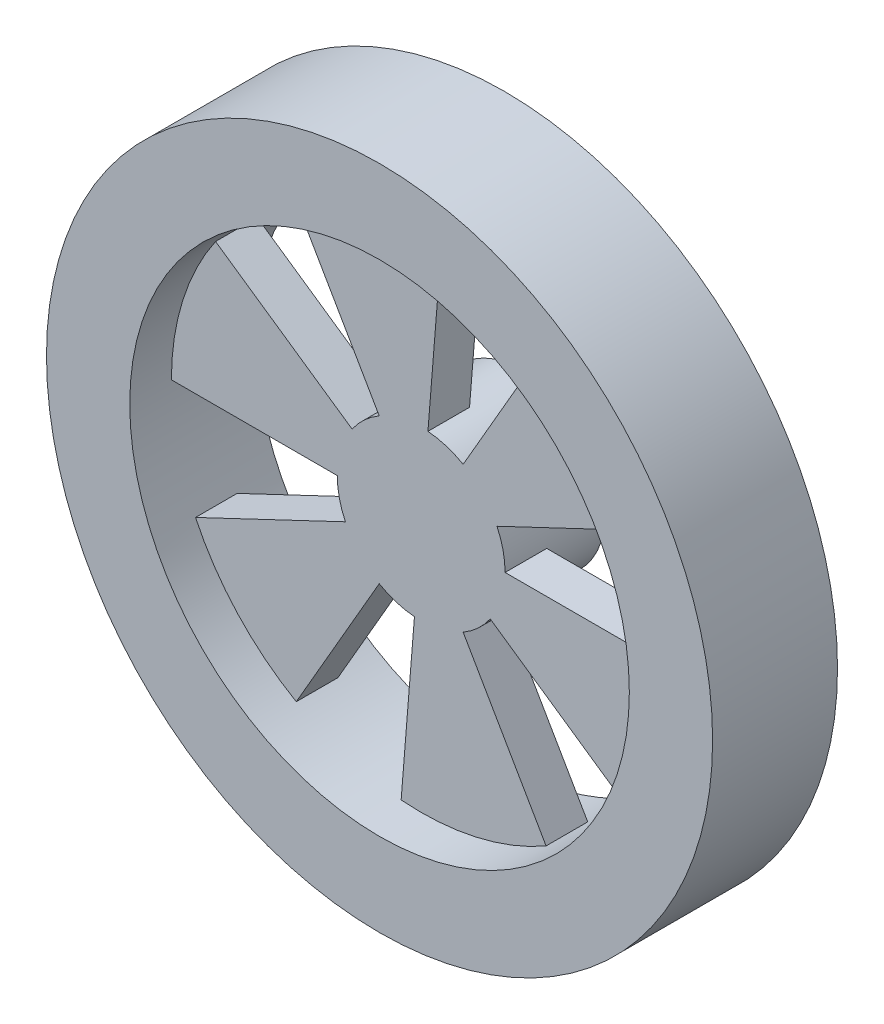
ISO-10303-21;
HEADER;
FILE_DESCRIPTION(('STEP AP214'),'2;1');
FILE_NAME('part.step','',(''),(''),'','','');
FILE_SCHEMA(('AUTOMOTIVE_DESIGN { 1 0 10303 214 1 1 1 1 }'));
ENDSEC;
DATA;
#1=APPLICATION_CONTEXT('core data for automotive mechanical design processes');
#2=APPLICATION_PROTOCOL_DEFINITION('international standard','automotive_design',2000,#1);
#3=PRODUCT_CONTEXT('',#1,'mechanical');
#4=PRODUCT('Part','Part','',(#3));
#5=PRODUCT_RELATED_PRODUCT_CATEGORY('part','',(#4));
#6=PRODUCT_DEFINITION_FORMATION('','',#4);
#7=PRODUCT_DEFINITION_CONTEXT('part definition',#1,'design');
#8=PRODUCT_DEFINITION('design','',#6,#7);
#9=PRODUCT_DEFINITION_SHAPE('','',#8);
#10=(LENGTH_UNIT() NAMED_UNIT(*) SI_UNIT(.MILLI.,.METRE.));
#11=(NAMED_UNIT(*) PLANE_ANGLE_UNIT() SI_UNIT($,.RADIAN.));
#12=(NAMED_UNIT(*) SI_UNIT($,.STERADIAN.) SOLID_ANGLE_UNIT());
#13=UNCERTAINTY_MEASURE_WITH_UNIT(LENGTH_MEASURE(1.E-05),#10,'distance_accuracy_value','');
#14=(GEOMETRIC_REPRESENTATION_CONTEXT(3) GLOBAL_UNCERTAINTY_ASSIGNED_CONTEXT((#13)) GLOBAL_UNIT_ASSIGNED_CONTEXT((#10,
#11,#12)) REPRESENTATION_CONTEXT('',''));
#15=CARTESIAN_POINT('',(0.,0.,0.));
#16=DIRECTION('',(0.,0.,1.));
#17=DIRECTION('',(1.,0.,0.));
#18=AXIS2_PLACEMENT_3D('',#15,#16,#17);
#19=CARTESIAN_POINT('',(0.,0.,5.));
#20=DIRECTION('',(0.,0.,-1.));
#21=DIRECTION('',(-1.,0.,0.));
#22=AXIS2_PLACEMENT_3D('',#19,#20,#21);
#23=PLANE('',#22);
#24=DIRECTION('',(0.0802856220974144,0.996771899124585,0.));
#25=VECTOR('',#24,1.);
#26=CARTESIAN_POINT('',(2.40856866292243,29.9031569737375,5.));
#27=LINE('',#26,#25);
#28=CARTESIAN_POINT('',(0.808992417805257,10.0439018544904,5.));
#29=VERTEX_POINT('',#28);
#30=CARTESIAN_POINT('',(2.40856866292243,29.9031569737375,5.));
#31=VERTEX_POINT('',#30);
#32=EDGE_CURVE('E263',#29,#31,#27,.T.);
#33=ORIENTED_EDGE('',*,*,#32,.F.);
#34=CARTESIAN_POINT('',(0.,0.,5.));
#35=DIRECTION('',(0.,0.,-1.));
#36=DIRECTION('',(-1.,0.,0.));
#37=AXIS2_PLACEMENT_3D('',#34,#35,#36);
#38=CIRCLE('',#37,10.0764295856569);
#39=CARTESIAN_POINT('',(-5.0382147928285,8.72644400062398,5.));
#40=VERTEX_POINT('',#39);
#41=EDGE_CURVE('E419',#40,#29,#38,.T.);
#42=ORIENTED_EDGE('',*,*,#41,.F.);
#43=DIRECTION('',(0.500000000000004,-0.866025403784436,0.));
#44=VECTOR('',#43,1.);
#45=CARTESIAN_POINT('',(-5.0382147928285,8.72644400062398,5.));
#46=LINE('',#45,#44);
#47=CARTESIAN_POINT('',(-15.0000000000001,25.9807621135331,5.));
#48=VERTEX_POINT('',#47);
#49=EDGE_CURVE('E288',#48,#40,#46,.T.);
#50=ORIENTED_EDGE('',*,*,#49,.F.);
#51=CARTESIAN_POINT('',(0.,0.,5.));
#52=DIRECTION('',(0.,0.,-1.));
#53=DIRECTION('',(-1.,0.,0.));
#54=AXIS2_PLACEMENT_3D('',#51,#52,#53);
#55=CIRCLE('',#54,30.);
#56=EDGE_CURVE('E426',#48,#31,#55,.T.);
#57=ORIENTED_EDGE('',*,*,#56,.T.);
#58=EDGE_LOOP('',(#33,#42,#50,#57));
#59=FACE_BOUND('',#58,.T.);
#60=ADVANCED_FACE('F39',(#59),#23,.T.);
#61=DIRECTION('',(-0.823086975371644,0.567915337857288,0.));
#62=VECTOR('',#61,1.);
#63=CARTESIAN_POINT('',(-24.6926092611493,17.0374601357187,5.));
#64=LINE('',#63,#62);
#65=CARTESIAN_POINT('',(-8.2937779502037,5.72255891253353,5.));
#66=VERTEX_POINT('',#65);
#67=CARTESIAN_POINT('',(-24.6926092611493,17.0374601357187,5.));
#68=VERTEX_POINT('',#67);
#69=EDGE_CURVE('E297',#66,#68,#64,.T.);
#70=ORIENTED_EDGE('',*,*,#69,.F.);
#71=CARTESIAN_POINT('',(-10.0764295856569,0.,5.));
#72=VERTEX_POINT('',#71);
#73=EDGE_CURVE('E415',#72,#66,#38,.T.);
#74=ORIENTED_EDGE('',*,*,#73,.F.);
#75=DIRECTION('',(1.,0.,0.));
#76=VECTOR('',#75,1.);
#77=CARTESIAN_POINT('',(-10.0764295856569,0.,5.));
#78=LINE('',#77,#76);
#79=CARTESIAN_POINT('',(-30.,-2.11223603806565E-13,5.));
#80=VERTEX_POINT('',#79);
#81=EDGE_CURVE('E350',#80,#72,#78,.T.);
#82=ORIENTED_EDGE('',*,*,#81,.F.);
#83=EDGE_CURVE('E421',#80,#68,#55,.T.);
#84=ORIENTED_EDGE('',*,*,#83,.T.);
#85=EDGE_LOOP('',(#70,#74,#82,#84));
#86=FACE_BOUND('',#85,.T.);
#87=ADVANCED_FACE('F498',(#86),#23,.T.);
#88=DIRECTION('',(-0.0802856220974074,-0.996771899124585,0.));
#89=VECTOR('',#88,1.);
#90=CARTESIAN_POINT('',(-2.40856866292222,-29.9031569737376,5.));
#91=LINE('',#90,#89);
#92=CARTESIAN_POINT('',(-0.808992417805189,-10.0439018544904,5.));
#93=VERTEX_POINT('',#92);
#94=CARTESIAN_POINT('',(-2.40856866292222,-29.9031569737376,5.));
#95=VERTEX_POINT('',#94);
#96=EDGE_CURVE('E244',#93,#95,#91,.T.);
#97=ORIENTED_EDGE('',*,*,#96,.F.);
#98=CARTESIAN_POINT('',(5.03821479282856,-8.72644400062394,5.));
#99=VERTEX_POINT('',#98);
#100=EDGE_CURVE('E565',#99,#93,#38,.T.);
#101=ORIENTED_EDGE('',*,*,#100,.F.);
#102=DIRECTION('',(-0.50000000000001,0.866025403784433,0.));
#103=VECTOR('',#102,1.);
#104=CARTESIAN_POINT('',(5.03821479282856,-8.72644400062394,5.));
#105=LINE('',#104,#103);
#106=CARTESIAN_POINT('',(15.0000000000003,-25.980762113533,5.));
#107=VERTEX_POINT('',#106);
#108=EDGE_CURVE('E231',#107,#99,#105,.T.);
#109=ORIENTED_EDGE('',*,*,#108,.F.);
#110=EDGE_CURVE('E540',#107,#95,#55,.T.);
#111=ORIENTED_EDGE('',*,*,#110,.T.);
#112=EDGE_LOOP('',(#97,#101,#109,#111));
#113=FACE_BOUND('',#112,.T.);
#114=ADVANCED_FACE('F505',(#113),#23,.T.);
#115=DIRECTION('',(0.499999999999992,0.866025403784443,0.));
#116=VECTOR('',#115,1.);
#117=CARTESIAN_POINT('',(-5.03821479282838,-8.72644400062405,5.));
#118=LINE('',#117,#116);
#119=CARTESIAN_POINT('',(-14.9999999999998,-25.9807621135333,5.));
#120=VERTEX_POINT('',#119);
#121=CARTESIAN_POINT('',(-5.03821479282838,-8.72644400062405,5.));
#122=VERTEX_POINT('',#121);
#123=EDGE_CURVE('E320',#120,#122,#118,.T.);
#124=ORIENTED_EDGE('',*,*,#123,.F.);
#125=CARTESIAN_POINT('',(-27.1011779240717,-12.865696838019,5.));
#126=VERTEX_POINT('',#125);
#127=EDGE_CURVE('E427',#120,#126,#55,.T.);
#128=ORIENTED_EDGE('',*,*,#127,.T.);
#129=DIRECTION('',(-0.903372597469055,-0.428856561267298,0.));
#130=VECTOR('',#129,1.);
#131=CARTESIAN_POINT('',(-27.1011779240717,-12.865696838019,5.));
#132=LINE('',#131,#130);
#133=CARTESIAN_POINT('',(-9.10277036800893,-4.3213429419569,5.));
#134=VERTEX_POINT('',#133);
#135=EDGE_CURVE('E337',#134,#126,#132,.T.);
#136=ORIENTED_EDGE('',*,*,#135,.F.);
#137=EDGE_CURVE('E420',#122,#134,#38,.T.);
#138=ORIENTED_EDGE('',*,*,#137,.F.);
#139=EDGE_LOOP('',(#124,#128,#136,#138));
#140=FACE_BOUND('',#139,.T.);
#141=ADVANCED_FACE('F525',(#140),#23,.T.);
#142=DIRECTION('',(0.823086975371648,-0.567915337857283,0.));
#143=VECTOR('',#142,1.);
#144=CARTESIAN_POINT('',(24.6926092611494,-17.0374601357185,5.));
#145=LINE('',#144,#143);
#146=CARTESIAN_POINT('',(8.29377795020374,-5.72255891253347,5.));
#147=VERTEX_POINT('',#146);
#148=CARTESIAN_POINT('',(24.6926092611494,-17.0374601357185,5.));
#149=VERTEX_POINT('',#148);
#150=EDGE_CURVE('E234',#147,#149,#145,.T.);
#151=ORIENTED_EDGE('',*,*,#150,.F.);
#152=CARTESIAN_POINT('',(10.0764295856569,0.,5.));
#153=VERTEX_POINT('',#152);
#154=EDGE_CURVE('E211',#153,#147,#38,.T.);
#155=ORIENTED_EDGE('',*,*,#154,.F.);
#156=DIRECTION('',(-1.,0.,0.));
#157=VECTOR('',#156,1.);
#158=CARTESIAN_POINT('',(10.0764295856569,0.,5.));
#159=LINE('',#158,#157);
#160=CARTESIAN_POINT('',(30.,0.,5.));
#161=VERTEX_POINT('',#160);
#162=EDGE_CURVE('E380',#161,#153,#159,.T.);
#163=ORIENTED_EDGE('',*,*,#162,.F.);
#164=EDGE_CURVE('E536',#161,#149,#55,.T.);
#165=ORIENTED_EDGE('',*,*,#164,.T.);
#166=EDGE_LOOP('',(#151,#155,#163,#165));
#167=FACE_BOUND('',#166,.T.);
#168=ADVANCED_FACE('F514',(#167),#23,.T.);
#169=CARTESIAN_POINT('',(0.,0.,10.));
#170=DIRECTION('',(0.,0.,1.));
#171=DIRECTION('',(1.,0.,0.));
#172=AXIS2_PLACEMENT_3D('',#169,#170,#171);
#173=PLANE('',#172);
#174=CARTESIAN_POINT('',(0.,0.,10.));
#175=DIRECTION('',(0.,0.,1.));
#176=DIRECTION('',(1.,0.,0.));
#177=AXIS2_PLACEMENT_3D('',#174,#175,#176);
#178=CIRCLE('',#177,30.);
#179=CARTESIAN_POINT('',(27.1011779240717,12.8656968380188,10.));
#180=VERTEX_POINT('',#179);
#181=CARTESIAN_POINT('',(14.9999999999999,25.9807621135332,10.));
#182=VERTEX_POINT('',#181);
#183=EDGE_CURVE('E411',#180,#182,#178,.T.);
#184=ORIENTED_EDGE('',*,*,#183,.T.);
#185=DIRECTION('',(-0.499999999999998,-0.86602540378444,0.));
#186=VECTOR('',#185,1.);
#187=CARTESIAN_POINT('',(5.03821479282844,8.72644400062401,10.));
#188=LINE('',#187,#186);
#189=CARTESIAN_POINT('',(5.03821479282844,8.72644400062401,10.));
#190=VERTEX_POINT('',#189);
#191=EDGE_CURVE('E258',#182,#190,#188,.T.);
#192=ORIENTED_EDGE('',*,*,#191,.T.);
#193=CARTESIAN_POINT('',(0.,0.,10.));
#194=DIRECTION('',(0.,0.,1.));
#195=DIRECTION('',(-1.,0.,0.));
#196=AXIS2_PLACEMENT_3D('',#193,#194,#195);
#197=CIRCLE('',#196,10.0764295856569);
#198=CARTESIAN_POINT('',(0.808992417805257,10.0439018544904,10.));
#199=VERTEX_POINT('',#198);
#200=EDGE_CURVE('E249',#190,#199,#197,.T.);
#201=ORIENTED_EDGE('',*,*,#200,.T.);
#202=DIRECTION('',(0.0802856220974144,0.996771899124585,0.));
#203=VECTOR('',#202,1.);
#204=CARTESIAN_POINT('',(2.40856866292243,29.9031569737375,10.));
#205=LINE('',#204,#203);
#206=CARTESIAN_POINT('',(2.40856866292243,29.9031569737375,10.));
#207=VERTEX_POINT('',#206);
#208=EDGE_CURVE('E253',#199,#207,#205,.T.);
#209=ORIENTED_EDGE('',*,*,#208,.T.);
#210=CARTESIAN_POINT('',(-15.0000000000001,25.9807621135331,10.));
#211=VERTEX_POINT('',#210);
#212=EDGE_CURVE('E569',#207,#211,#178,.T.);
#213=ORIENTED_EDGE('',*,*,#212,.T.);
#214=DIRECTION('',(0.500000000000004,-0.866025403784436,0.));
#215=VECTOR('',#214,1.);
#216=CARTESIAN_POINT('',(-5.0382147928285,8.72644400062398,10.));
#217=LINE('',#216,#215);
#218=CARTESIAN_POINT('',(-5.0382147928285,8.72644400062398,10.));
#219=VERTEX_POINT('',#218);
#220=EDGE_CURVE('E292',#211,#219,#217,.T.);
#221=ORIENTED_EDGE('',*,*,#220,.T.);
#222=CARTESIAN_POINT('',(0.,0.,10.));
#223=DIRECTION('',(0.,0.,1.));
#224=DIRECTION('',(-1.,0.,0.));
#225=AXIS2_PLACEMENT_3D('',#222,#223,#224);
#226=CIRCLE('',#225,10.0764295856569);
#227=CARTESIAN_POINT('',(-8.2937779502037,5.72255891253353,10.));
#228=VERTEX_POINT('',#227);
#229=EDGE_CURVE('E283',#219,#228,#226,.T.);
#230=ORIENTED_EDGE('',*,*,#229,.T.);
#231=DIRECTION('',(-0.823086975371644,0.567915337857288,0.));
#232=VECTOR('',#231,1.);
#233=CARTESIAN_POINT('',(-24.6926092611493,17.0374601357187,10.));
#234=LINE('',#233,#232);
#235=CARTESIAN_POINT('',(-24.6926092611493,17.0374601357187,10.));
#236=VERTEX_POINT('',#235);
#237=EDGE_CURVE('E287',#228,#236,#234,.T.);
#238=ORIENTED_EDGE('',*,*,#237,.T.);
#239=CARTESIAN_POINT('',(-30.,-2.11223603806565E-13,10.));
#240=VERTEX_POINT('',#239);
#241=EDGE_CURVE('E573',#236,#240,#178,.T.);
#242=ORIENTED_EDGE('',*,*,#241,.T.);
#243=DIRECTION('',(1.,0.,0.));
#244=VECTOR('',#243,1.);
#245=CARTESIAN_POINT('',(-10.0764295856569,0.,10.));
#246=LINE('',#245,#244);
#247=CARTESIAN_POINT('',(-10.0764295856569,0.,10.));
#248=VERTEX_POINT('',#247);
#249=EDGE_CURVE('E354',#240,#248,#246,.T.);
#250=ORIENTED_EDGE('',*,*,#249,.T.);
#251=CARTESIAN_POINT('',(0.,0.,10.));
#252=DIRECTION('',(0.,0.,1.));
#253=DIRECTION('',(-1.,0.,0.));
#254=AXIS2_PLACEMENT_3D('',#251,#252,#253);
#255=CIRCLE('',#254,10.0764295856569);
#256=CARTESIAN_POINT('',(-9.10277036800893,-4.3213429419569,10.));
#257=VERTEX_POINT('',#256);
#258=EDGE_CURVE('E345',#248,#257,#255,.T.);
#259=ORIENTED_EDGE('',*,*,#258,.T.);
#260=DIRECTION('',(-0.903372597469055,-0.428856561267298,0.));
#261=VECTOR('',#260,1.);
#262=CARTESIAN_POINT('',(-27.1011779240717,-12.865696838019,10.));
#263=LINE('',#262,#261);
#264=CARTESIAN_POINT('',(-27.1011779240717,-12.865696838019,10.));
#265=VERTEX_POINT('',#264);
#266=EDGE_CURVE('E349',#257,#265,#263,.T.);
#267=ORIENTED_EDGE('',*,*,#266,.T.);
#268=CARTESIAN_POINT('',(-14.9999999999998,-25.9807621135333,10.));
#269=VERTEX_POINT('',#268);
#270=EDGE_CURVE('E558',#265,#269,#178,.T.);
#271=ORIENTED_EDGE('',*,*,#270,.T.);
#272=DIRECTION('',(0.499999999999992,0.866025403784443,0.));
#273=VECTOR('',#272,1.);
#274=CARTESIAN_POINT('',(-5.03821479282838,-8.72644400062405,10.));
#275=LINE('',#274,#273);
#276=CARTESIAN_POINT('',(-5.03821479282838,-8.72644400062405,10.));
#277=VERTEX_POINT('',#276);
#278=EDGE_CURVE('E324',#269,#277,#275,.T.);
#279=ORIENTED_EDGE('',*,*,#278,.T.);
#280=CARTESIAN_POINT('',(0.,0.,10.));
#281=DIRECTION('',(0.,0.,1.));
#282=DIRECTION('',(-1.,0.,0.));
#283=AXIS2_PLACEMENT_3D('',#280,#281,#282);
#284=CIRCLE('',#283,10.0764295856569);
#285=CARTESIAN_POINT('',(-0.808992417805189,-10.0439018544904,10.));
#286=VERTEX_POINT('',#285);
#287=EDGE_CURVE('E315',#277,#286,#284,.T.);
#288=ORIENTED_EDGE('',*,*,#287,.T.);
#289=DIRECTION('',(-0.0802856220974074,-0.996771899124585,0.));
#290=VECTOR('',#289,1.);
#291=CARTESIAN_POINT('',(-2.40856866292222,-29.9031569737376,10.));
#292=LINE('',#291,#290);
#293=CARTESIAN_POINT('',(-2.40856866292222,-29.9031569737376,10.));
#294=VERTEX_POINT('',#293);
#295=EDGE_CURVE('E319',#286,#294,#292,.T.);
#296=ORIENTED_EDGE('',*,*,#295,.T.);
#297=CARTESIAN_POINT('',(15.0000000000003,-25.980762113533,10.));
#298=VERTEX_POINT('',#297);
#299=EDGE_CURVE('E410',#294,#298,#178,.T.);
#300=ORIENTED_EDGE('',*,*,#299,.T.);
#301=DIRECTION('',(-0.50000000000001,0.866025403784433,0.));
#302=VECTOR('',#301,1.);
#303=CARTESIAN_POINT('',(5.03821479282856,-8.72644400062394,10.));
#304=LINE('',#303,#302);
#305=CARTESIAN_POINT('',(5.03821479282856,-8.72644400062394,10.));
#306=VERTEX_POINT('',#305);
#307=EDGE_CURVE('E217',#298,#306,#304,.T.);
#308=ORIENTED_EDGE('',*,*,#307,.T.);
#309=CARTESIAN_POINT('',(0.,0.,10.));
#310=DIRECTION('',(0.,0.,1.));
#311=DIRECTION('',(-1.,0.,0.));
#312=AXIS2_PLACEMENT_3D('',#309,#310,#311);
#313=CIRCLE('',#312,10.0764295856569);
#314=CARTESIAN_POINT('',(8.29377795020374,-5.72255891253347,10.));
#315=VERTEX_POINT('',#314);
#316=EDGE_CURVE('E208',#306,#315,#313,.T.);
#317=ORIENTED_EDGE('',*,*,#316,.T.);
#318=DIRECTION('',(0.823086975371648,-0.567915337857283,0.));
#319=VECTOR('',#318,1.);
#320=CARTESIAN_POINT('',(24.6926092611494,-17.0374601357185,10.));
#321=LINE('',#320,#319);
#322=CARTESIAN_POINT('',(24.6926092611494,-17.0374601357185,10.));
#323=VERTEX_POINT('',#322);
#324=EDGE_CURVE('E220',#315,#323,#321,.T.);
#325=ORIENTED_EDGE('',*,*,#324,.T.);
#326=CARTESIAN_POINT('',(30.,0.,10.));
#327=VERTEX_POINT('',#326);
#328=EDGE_CURVE('E407',#323,#327,#178,.T.);
#329=ORIENTED_EDGE('',*,*,#328,.T.);
#330=DIRECTION('',(-1.,0.,0.));
#331=VECTOR('',#330,1.);
#332=CARTESIAN_POINT('',(10.0764295856569,0.,10.));
#333=LINE('',#332,#331);
#334=CARTESIAN_POINT('',(10.0764295856569,0.,10.));
#335=VERTEX_POINT('',#334);
#336=EDGE_CURVE('E384',#327,#335,#333,.T.);
#337=ORIENTED_EDGE('',*,*,#336,.T.);
#338=CARTESIAN_POINT('',(0.,0.,10.));
#339=DIRECTION('',(0.,0.,1.));
#340=DIRECTION('',(-1.,0.,0.));
#341=AXIS2_PLACEMENT_3D('',#338,#339,#340);
#342=CIRCLE('',#341,10.0764295856569);
#343=CARTESIAN_POINT('',(9.10277036800896,4.32134294195683,10.));
#344=VERTEX_POINT('',#343);
#345=EDGE_CURVE('E375',#335,#344,#342,.T.);
#346=ORIENTED_EDGE('',*,*,#345,.T.);
#347=DIRECTION('',(0.903372597469058,0.428856561267292,0.));
#348=VECTOR('',#347,1.);
#349=CARTESIAN_POINT('',(27.1011779240717,12.8656968380188,10.));
#350=LINE('',#349,#348);
#351=EDGE_CURVE('E379',#344,#180,#350,.T.);
#352=ORIENTED_EDGE('',*,*,#351,.T.);
#353=EDGE_LOOP('',(#184,#192,#201,#209,#213,#221,#230,#238,#242,#250,#259,#267,#271,#279,#288,
#296,#300,#308,#317,#325,#329,#337,#346,#352));
#354=FACE_BOUND('',#353,.T.);
#355=ADVANCED_FACE('F228',(#354),#173,.T.);
#356=CARTESIAN_POINT('',(0.,0.,-20.));
#357=DIRECTION('',(0.,0.,1.));
#358=DIRECTION('',(1.,0.,0.));
#359=AXIS2_PLACEMENT_3D('',#356,#357,#358);
#360=CYLINDRICAL_SURFACE('',#359,7.5);
#361=CARTESIAN_POINT('',(0.,0.,-20.));
#362=DIRECTION('',(0.,0.,1.));
#363=DIRECTION('',(1.,0.,0.));
#364=AXIS2_PLACEMENT_3D('',#361,#362,#363);
#365=CIRCLE('',#364,7.5);
#366=CARTESIAN_POINT('',(7.5,0.,-20.));
#367=VERTEX_POINT('',#366);
#368=EDGE_CURVE('E463',#367,#367,#365,.T.);
#369=ORIENTED_EDGE('',*,*,#368,.T.);
#370=EDGE_LOOP('',(#369));
#371=FACE_BOUND('',#370,.T.);
#372=CARTESIAN_POINT('',(0.,0.,-13.5));
#373=DIRECTION('',(0.,0.,-1.));
#374=DIRECTION('',(-1.,0.,0.));
#375=AXIS2_PLACEMENT_3D('',#372,#373,#374);
#376=CIRCLE('',#375,7.5);
#377=CARTESIAN_POINT('',(-7.5,0.,-13.5));
#378=VERTEX_POINT('',#377);
#379=EDGE_CURVE('E442',#378,#378,#376,.T.);
#380=ORIENTED_EDGE('',*,*,#379,.T.);
#381=EDGE_LOOP('',(#380));
#382=FACE_BOUND('',#381,.T.);
#383=ADVANCED_FACE('F531',(#371,#382),#360,.T.);
#384=CARTESIAN_POINT('',(0.,0.,-20.));
#385=DIRECTION('',(0.,0.,1.));
#386=DIRECTION('',(1.,0.,0.));
#387=AXIS2_PLACEMENT_3D('',#384,#385,#386);
#388=PLANE('',#387);
#389=CARTESIAN_POINT('',(0.,0.,-20.));
#390=DIRECTION('',(0.,0.,-1.));
#391=DIRECTION('',(-1.,0.,0.));
#392=AXIS2_PLACEMENT_3D('',#389,#390,#391);
#393=CIRCLE('',#392,3.175);
#394=CARTESIAN_POINT('',(-3.175,0.,-20.));
#395=VERTEX_POINT('',#394);
#396=EDGE_CURVE('E450',#395,#395,#393,.T.);
#397=ORIENTED_EDGE('',*,*,#396,.F.);
#398=EDGE_LOOP('',(#397));
#399=FACE_BOUND('',#398,.T.);
#400=ORIENTED_EDGE('',*,*,#368,.F.);
#401=EDGE_LOOP('',(#400));
#402=FACE_BOUND('',#401,.T.);
#403=ADVANCED_FACE('F834',(#399,#402),#388,.F.);
#404=CARTESIAN_POINT('',(0.,0.,-18.4));
#405=DIRECTION('',(0.,0.,-1.));
#406=DIRECTION('',(-1.,0.,0.));
#407=AXIS2_PLACEMENT_3D('',#404,#405,#406);
#408=PLANE('',#407);
#409=CARTESIAN_POINT('',(0.,0.,-18.4));
#410=DIRECTION('',(0.,0.,-1.));
#411=DIRECTION('',(-1.,0.,0.));
#412=AXIS2_PLACEMENT_3D('',#409,#410,#411);
#413=CIRCLE('',#412,3.175);
#414=CARTESIAN_POINT('',(-3.175,0.,-18.4));
#415=VERTEX_POINT('',#414);
#416=EDGE_CURVE('E451',#415,#415,#413,.T.);
#417=ORIENTED_EDGE('',*,*,#416,.T.);
#418=EDGE_LOOP('',(#417));
#419=FACE_BOUND('',#418,.T.);
#420=CARTESIAN_POINT('',(0.,0.,-18.4));
#421=DIRECTION('',(0.,0.,-1.));
#422=DIRECTION('',(-1.,0.,0.));
#423=AXIS2_PLACEMENT_3D('',#420,#421,#422);
#424=CIRCLE('',#423,1.);
#425=CARTESIAN_POINT('',(-1.,0.,-18.4));
#426=VERTEX_POINT('',#425);
#427=EDGE_CURVE('E455',#426,#426,#424,.F.);
#428=ORIENTED_EDGE('',*,*,#427,.T.);
#429=EDGE_LOOP('',(#428));
#430=FACE_BOUND('',#429,.T.);
#431=ADVANCED_FACE('F477',(#419,#430),#408,.T.);
#432=CARTESIAN_POINT('',(0.,0.,-18.4));
#433=DIRECTION('',(0.,0.,-1.));
#434=DIRECTION('',(-1.,0.,0.));
#435=AXIS2_PLACEMENT_3D('',#432,#433,#434);
#436=CYLINDRICAL_SURFACE('',#435,3.175);
#437=ORIENTED_EDGE('',*,*,#416,.F.);
#438=EDGE_LOOP('',(#437));
#439=FACE_BOUND('',#438,.T.);
#440=ORIENTED_EDGE('',*,*,#396,.T.);
#441=EDGE_LOOP('',(#440));
#442=FACE_BOUND('',#441,.T.);
#443=ADVANCED_FACE('F492',(#439,#442),#436,.F.);
#444=CARTESIAN_POINT('',(0.,0.,0.));
#445=DIRECTION('',(0.,0.,1.));
#446=DIRECTION('',(1.,0.,0.));
#447=AXIS2_PLACEMENT_3D('',#444,#445,#446);
#448=PLANE('',#447);
#449=CARTESIAN_POINT('',(0.,0.,0.));
#450=DIRECTION('',(0.,0.,1.));
#451=DIRECTION('',(1.,0.,0.));
#452=AXIS2_PLACEMENT_3D('',#449,#450,#451);
#453=CIRCLE('',#452,1.);
#454=CARTESIAN_POINT('',(1.,0.,0.));
#455=VERTEX_POINT('',#454);
#456=EDGE_CURVE('E48',#455,#455,#453,.T.);
#457=ORIENTED_EDGE('',*,*,#456,.F.);
#458=EDGE_LOOP('',(#457));
#459=FACE_BOUND('',#458,.T.);
#460=ADVANCED_FACE('F482',(#459),#448,.F.);
#461=CARTESIAN_POINT('',(0.,0.,-20.));
#462=DIRECTION('',(0.,0.,1.));
#463=DIRECTION('',(1.,0.,0.));
#464=AXIS2_PLACEMENT_3D('',#461,#462,#463);
#465=CYLINDRICAL_SURFACE('',#464,1.);
#466=ORIENTED_EDGE('',*,*,#456,.T.);
#467=EDGE_LOOP('',(#466));
#468=FACE_BOUND('',#467,.T.);
#469=ORIENTED_EDGE('',*,*,#427,.F.);
#470=EDGE_LOOP('',(#469));
#471=FACE_BOUND('',#470,.T.);
#472=ADVANCED_FACE('F479',(#468,#471),#465,.F.);
#473=CARTESIAN_POINT('',(0.,7.5,-13.5));
#474=DIRECTION('',(0.,0.,1.));
#475=DIRECTION('',(1.,0.,0.));
#476=AXIS2_PLACEMENT_3D('',#473,#474,#475);
#477=PLANE('',#476);
#478=CARTESIAN_POINT('',(0.,0.,-13.5));
#479=DIRECTION('',(0.,0.,-1.));
#480=DIRECTION('',(-1.,0.,0.));
#481=AXIS2_PLACEMENT_3D('',#478,#479,#480);
#482=CIRCLE('',#481,6.5);
#483=CARTESIAN_POINT('',(-6.5,0.,-13.5));
#484=VERTEX_POINT('',#483);
#485=EDGE_CURVE('E438',#484,#484,#482,.T.);
#486=ORIENTED_EDGE('',*,*,#485,.T.);
#487=EDGE_LOOP('',(#486));
#488=FACE_BOUND('',#487,.T.);
#489=ORIENTED_EDGE('',*,*,#379,.F.);
#490=EDGE_LOOP('',(#489));
#491=FACE_BOUND('',#490,.T.);
#492=ADVANCED_FACE('F481',(#488,#491),#477,.T.);
#493=CARTESIAN_POINT('',(0.,0.,-21.75));
#494=DIRECTION('',(0.,0.,-1.));
#495=DIRECTION('',(-1.,0.,0.));
#496=AXIS2_PLACEMENT_3D('',#493,#494,#495);
#497=CYLINDRICAL_SURFACE('',#496,6.5);
#498=ORIENTED_EDGE('',*,*,#485,.F.);
#499=EDGE_LOOP('',(#498));
#500=FACE_BOUND('',#499,.T.);
#501=CARTESIAN_POINT('',(0.,0.,-12.));
#502=DIRECTION('',(0.,0.,-1.));
#503=DIRECTION('',(-1.,0.,0.));
#504=AXIS2_PLACEMENT_3D('',#501,#502,#503);
#505=CIRCLE('',#504,6.5);
#506=CARTESIAN_POINT('',(-6.5,0.,-12.));
#507=VERTEX_POINT('',#506);
#508=EDGE_CURVE('E434',#507,#507,#505,.T.);
#509=ORIENTED_EDGE('',*,*,#508,.T.);
#510=EDGE_LOOP('',(#509));
#511=FACE_BOUND('',#510,.T.);
#512=ADVANCED_FACE('F489',(#500,#511),#497,.T.);
#513=CARTESIAN_POINT('',(0.,7.5,-12.));
#514=DIRECTION('',(0.,0.,1.));
#515=DIRECTION('',(1.,0.,0.));
#516=AXIS2_PLACEMENT_3D('',#513,#514,#515);
#517=PLANE('',#516);
#518=ORIENTED_EDGE('',*,*,#508,.F.);
#519=EDGE_LOOP('',(#518));
#520=FACE_BOUND('',#519,.T.);
#521=CARTESIAN_POINT('',(0.,0.,-12.));
#522=DIRECTION('',(0.,0.,-1.));
#523=DIRECTION('',(-1.,0.,0.));
#524=AXIS2_PLACEMENT_3D('',#521,#522,#523);
#525=CIRCLE('',#524,7.5);
#526=CARTESIAN_POINT('',(-7.5,0.,-12.));
#527=VERTEX_POINT('',#526);
#528=EDGE_CURVE('E425',#527,#527,#525,.T.);
#529=ORIENTED_EDGE('',*,*,#528,.T.);
#530=EDGE_LOOP('',(#529));
#531=FACE_BOUND('',#530,.T.);
#532=ADVANCED_FACE('F784',(#520,#531),#517,.F.);
#533=CARTESIAN_POINT('',(0.,0.,-21.75));
#534=DIRECTION('',(0.,0.,-1.));
#535=DIRECTION('',(-1.,0.,0.));
#536=AXIS2_PLACEMENT_3D('',#533,#534,#535);
#537=CYLINDRICAL_SURFACE('',#536,10.0764295856569);
#538=CARTESIAN_POINT('',(0.,0.,-2.));
#539=DIRECTION('',(0.,0.,-1.));
#540=DIRECTION('',(-1.,0.,0.));
#541=AXIS2_PLACEMENT_3D('',#538,#539,#540);
#542=CIRCLE('',#541,10.0764295856569);
#543=CARTESIAN_POINT('',(-10.0764295856569,0.,-2.));
#544=VERTEX_POINT('',#543);
#545=EDGE_CURVE('E446',#544,#544,#542,.T.);
#546=ORIENTED_EDGE('',*,*,#545,.F.);
#547=EDGE_LOOP('',(#546));
#548=FACE_BOUND('',#547,.T.);
#549=ORIENTED_EDGE('',*,*,#73,.T.);
#550=DIRECTION('',(0.,0.,-1.));
#551=VECTOR('',#550,1.);
#552=CARTESIAN_POINT('',(-8.2937779502037,5.72255891253353,10.));
#553=LINE('',#552,#551);
#554=EDGE_CURVE('E296',#228,#66,#553,.T.);
#555=ORIENTED_EDGE('',*,*,#554,.F.);
#556=ORIENTED_EDGE('',*,*,#229,.F.);
#557=DIRECTION('',(0.,0.,-1.));
#558=VECTOR('',#557,1.);
#559=CARTESIAN_POINT('',(-5.0382147928285,8.72644400062398,10.));
#560=LINE('',#559,#558);
#561=EDGE_CURVE('E267',#219,#40,#560,.T.);
#562=ORIENTED_EDGE('',*,*,#561,.T.);
#563=ORIENTED_EDGE('',*,*,#41,.T.);
#564=DIRECTION('',(0.,0.,-1.));
#565=VECTOR('',#564,1.);
#566=CARTESIAN_POINT('',(0.808992417805257,10.0439018544904,10.));
#567=LINE('',#566,#565);
#568=EDGE_CURVE('E262',#199,#29,#567,.T.);
#569=ORIENTED_EDGE('',*,*,#568,.F.);
#570=ORIENTED_EDGE('',*,*,#200,.F.);
#571=DIRECTION('',(0.,0.,-1.));
#572=VECTOR('',#571,1.);
#573=CARTESIAN_POINT('',(5.03821479282844,8.72644400062401,10.));
#574=LINE('',#573,#572);
#575=CARTESIAN_POINT('',(5.03821479282844,8.72644400062401,5.));
#576=VERTEX_POINT('',#575);
#577=EDGE_CURVE('E271',#190,#576,#574,.T.);
#578=ORIENTED_EDGE('',*,*,#577,.T.);
#579=CARTESIAN_POINT('',(9.10277036800896,4.32134294195683,5.));
#580=VERTEX_POINT('',#579);
#581=EDGE_CURVE('E951',#576,#580,#38,.T.);
#582=ORIENTED_EDGE('',*,*,#581,.T.);
#583=DIRECTION('',(0.,0.,-1.));
#584=VECTOR('',#583,1.);
#585=CARTESIAN_POINT('',(9.10277036800896,4.32134294195683,10.));
#586=LINE('',#585,#584);
#587=EDGE_CURVE('E388',#344,#580,#586,.T.);
#588=ORIENTED_EDGE('',*,*,#587,.F.);
#589=ORIENTED_EDGE('',*,*,#345,.F.);
#590=DIRECTION('',(0.,0.,-1.));
#591=VECTOR('',#590,1.);
#592=CARTESIAN_POINT('',(10.0764295856569,0.,10.));
#593=LINE('',#592,#591);
#594=EDGE_CURVE('E395',#335,#153,#593,.T.);
#595=ORIENTED_EDGE('',*,*,#594,.T.);
#596=ORIENTED_EDGE('',*,*,#154,.T.);
#597=DIRECTION('',(0.,0.,-1.));
#598=VECTOR('',#597,1.);
#599=CARTESIAN_POINT('',(8.29377795020374,-5.72255891253347,10.));
#600=LINE('',#599,#598);
#601=EDGE_CURVE('E203',#315,#147,#600,.T.);
#602=ORIENTED_EDGE('',*,*,#601,.F.);
#603=ORIENTED_EDGE('',*,*,#316,.F.);
#604=DIRECTION('',(0.,0.,-1.));
#605=VECTOR('',#604,1.);
#606=CARTESIAN_POINT('',(5.03821479282856,-8.72644400062394,10.));
#607=LINE('',#606,#605);
#608=EDGE_CURVE('E241',#306,#99,#607,.T.);
#609=ORIENTED_EDGE('',*,*,#608,.T.);
#610=ORIENTED_EDGE('',*,*,#100,.T.);
#611=DIRECTION('',(0.,0.,-1.));
#612=VECTOR('',#611,1.);
#613=CARTESIAN_POINT('',(-0.808992417805189,-10.0439018544904,10.));
#614=LINE('',#613,#612);
#615=EDGE_CURVE('E328',#286,#93,#614,.T.);
#616=ORIENTED_EDGE('',*,*,#615,.F.);
#617=ORIENTED_EDGE('',*,*,#287,.F.);
#618=DIRECTION('',(0.,0.,-1.));
#619=VECTOR('',#618,1.);
#620=CARTESIAN_POINT('',(-5.03821479282838,-8.72644400062405,10.));
#621=LINE('',#620,#619);
#622=EDGE_CURVE('E334',#277,#122,#621,.T.);
#623=ORIENTED_EDGE('',*,*,#622,.T.);
#624=ORIENTED_EDGE('',*,*,#137,.T.);
#625=DIRECTION('',(0.,0.,-1.));
#626=VECTOR('',#625,1.);
#627=CARTESIAN_POINT('',(-9.10277036800893,-4.3213429419569,10.));
#628=LINE('',#627,#626);
#629=EDGE_CURVE('E358',#257,#134,#628,.T.);
#630=ORIENTED_EDGE('',*,*,#629,.F.);
#631=ORIENTED_EDGE('',*,*,#258,.F.);
#632=DIRECTION('',(0.,0.,-1.));
#633=VECTOR('',#632,1.);
#634=CARTESIAN_POINT('',(-10.0764295856569,0.,10.));
#635=LINE('',#634,#633);
#636=EDGE_CURVE('E301',#248,#72,#635,.T.);
#637=ORIENTED_EDGE('',*,*,#636,.T.);
#638=EDGE_LOOP('',(#549,#555,#556,#562,#563,#569,#570,#578,#582,#588,#589,#595,#596,#602,#603,
#609,#610,#616,#617,#623,#624,#630,#631,#637));
#639=FACE_BOUND('',#638,.T.);
#640=ADVANCED_FACE('F206',(#548,#639),#537,.T.);
#641=CARTESIAN_POINT('',(0.,7.5,-2.));
#642=DIRECTION('',(0.,0.,-1.));
#643=DIRECTION('',(-1.,0.,0.));
#644=AXIS2_PLACEMENT_3D('',#641,#642,#643);
#645=PLANE('',#644);
#646=ORIENTED_EDGE('',*,*,#545,.T.);
#647=EDGE_LOOP('',(#646));
#648=FACE_BOUND('',#647,.T.);
#649=CARTESIAN_POINT('',(0.,0.,-2.));
#650=DIRECTION('',(0.,0.,-1.));
#651=DIRECTION('',(-1.,0.,0.));
#652=AXIS2_PLACEMENT_3D('',#649,#650,#651);
#653=CIRCLE('',#652,7.5);
#654=CARTESIAN_POINT('',(-7.5,0.,-2.));
#655=VERTEX_POINT('',#654);
#656=EDGE_CURVE('E11',#655,#655,#653,.F.);
#657=ORIENTED_EDGE('',*,*,#656,.T.);
#658=EDGE_LOOP('',(#657));
#659=FACE_BOUND('',#658,.T.);
#660=ADVANCED_FACE('F783',(#648,#659),#645,.T.);
#661=ORIENTED_EDGE('',*,*,#528,.F.);
#662=EDGE_LOOP('',(#661));
#663=FACE_BOUND('',#662,.T.);
#664=ORIENTED_EDGE('',*,*,#656,.F.);
#665=EDGE_LOOP('',(#664));
#666=FACE_BOUND('',#665,.T.);
#667=ADVANCED_FACE('F521',(#663,#666),#360,.T.);
#668=CARTESIAN_POINT('',(0.,0.,5.));
#669=DIRECTION('',(0.,0.,-1.));
#670=DIRECTION('',(-1.,0.,0.));
#671=AXIS2_PLACEMENT_3D('',#668,#669,#670);
#672=CYLINDRICAL_SURFACE('',#671,30.);
#673=CARTESIAN_POINT('',(14.9999999999999,25.9807621135332,5.));
#674=VERTEX_POINT('',#673);
#675=CARTESIAN_POINT('',(27.1011779240717,12.8656968380188,5.));
#676=VERTEX_POINT('',#675);
#677=EDGE_CURVE('E539',#674,#676,#55,.T.);
#678=ORIENTED_EDGE('',*,*,#677,.F.);
#679=DIRECTION('',(0.,0.,-1.));
#680=VECTOR('',#679,1.);
#681=CARTESIAN_POINT('',(14.9999999999999,25.9807621135332,10.));
#682=LINE('',#681,#680);
#683=EDGE_CURVE('E275',#182,#674,#682,.T.);
#684=ORIENTED_EDGE('',*,*,#683,.F.);
#685=ORIENTED_EDGE('',*,*,#183,.F.);
#686=DIRECTION('',(0.,0.,-1.));
#687=VECTOR('',#686,1.);
#688=CARTESIAN_POINT('',(27.1011779240717,12.8656968380188,10.));
#689=LINE('',#688,#687);
#690=EDGE_CURVE('E402',#180,#676,#689,.T.);
#691=ORIENTED_EDGE('',*,*,#690,.T.);
#692=EDGE_LOOP('',(#678,#684,#685,#691));
#693=FACE_BOUND('',#692,.T.);
#694=ORIENTED_EDGE('',*,*,#56,.F.);
#695=DIRECTION('',(0.,0.,-1.));
#696=VECTOR('',#695,1.);
#697=CARTESIAN_POINT('',(-15.0000000000001,25.9807621135331,10.));
#698=LINE('',#697,#696);
#699=EDGE_CURVE('E307',#211,#48,#698,.T.);
#700=ORIENTED_EDGE('',*,*,#699,.F.);
#701=ORIENTED_EDGE('',*,*,#212,.F.);
#702=DIRECTION('',(0.,0.,-1.));
#703=VECTOR('',#702,1.);
#704=CARTESIAN_POINT('',(2.40856866292243,29.9031569737375,10.));
#705=LINE('',#704,#703);
#706=EDGE_CURVE('E278',#207,#31,#705,.T.);
#707=ORIENTED_EDGE('',*,*,#706,.T.);
#708=EDGE_LOOP('',(#694,#700,#701,#707));
#709=FACE_BOUND('',#708,.T.);
#710=ORIENTED_EDGE('',*,*,#127,.F.);
#711=DIRECTION('',(0.,0.,-1.));
#712=VECTOR('',#711,1.);
#713=CARTESIAN_POINT('',(-14.9999999999998,-25.9807621135333,10.));
#714=LINE('',#713,#712);
#715=EDGE_CURVE('E55',#269,#120,#714,.T.);
#716=ORIENTED_EDGE('',*,*,#715,.F.);
#717=ORIENTED_EDGE('',*,*,#270,.F.);
#718=DIRECTION('',(0.,0.,-1.));
#719=VECTOR('',#718,1.);
#720=CARTESIAN_POINT('',(-27.1011779240717,-12.865696838019,10.));
#721=LINE('',#720,#719);
#722=EDGE_CURVE('E370',#265,#126,#721,.T.);
#723=ORIENTED_EDGE('',*,*,#722,.T.);
#724=EDGE_LOOP('',(#710,#716,#717,#723));
#725=FACE_BOUND('',#724,.T.);
#726=ORIENTED_EDGE('',*,*,#83,.F.);
#727=DIRECTION('',(0.,0.,-1.));
#728=VECTOR('',#727,1.);
#729=CARTESIAN_POINT('',(-30.,-2.11223603806565E-13,10.));
#730=LINE('',#729,#728);
#731=EDGE_CURVE('E367',#240,#80,#730,.T.);
#732=ORIENTED_EDGE('',*,*,#731,.F.);
#733=ORIENTED_EDGE('',*,*,#241,.F.);
#734=DIRECTION('',(0.,0.,-1.));
#735=VECTOR('',#734,1.);
#736=CARTESIAN_POINT('',(-24.6926092611493,17.0374601357187,10.));
#737=LINE('',#736,#735);
#738=EDGE_CURVE('E310',#236,#68,#737,.T.);
#739=ORIENTED_EDGE('',*,*,#738,.T.);
#740=EDGE_LOOP('',(#726,#732,#733,#739));
#741=FACE_BOUND('',#740,.T.);
#742=ORIENTED_EDGE('',*,*,#110,.F.);
#743=DIRECTION('',(0.,0.,-1.));
#744=VECTOR('',#743,1.);
#745=CARTESIAN_POINT('',(15.0000000000003,-25.980762113533,10.));
#746=LINE('',#745,#744);
#747=EDGE_CURVE('E63',#298,#107,#746,.T.);
#748=ORIENTED_EDGE('',*,*,#747,.F.);
#749=ORIENTED_EDGE('',*,*,#299,.F.);
#750=DIRECTION('',(0.,0.,-1.));
#751=VECTOR('',#750,1.);
#752=CARTESIAN_POINT('',(-2.40856866292222,-29.9031569737376,10.));
#753=LINE('',#752,#751);
#754=EDGE_CURVE('E340',#294,#95,#753,.T.);
#755=ORIENTED_EDGE('',*,*,#754,.T.);
#756=EDGE_LOOP('',(#742,#748,#749,#755));
#757=FACE_BOUND('',#756,.T.);
#758=DIRECTION('',(0.,0.,-1.));
#759=VECTOR('',#758,1.);
#760=CARTESIAN_POINT('',(24.6926092611494,-17.0374601357185,10.));
#761=LINE('',#760,#759);
#762=EDGE_CURVE('E216',#323,#149,#761,.T.);
#763=ORIENTED_EDGE('',*,*,#762,.T.);
#764=ORIENTED_EDGE('',*,*,#164,.F.);
#765=DIRECTION('',(0.,0.,-1.));
#766=VECTOR('',#765,1.);
#767=CARTESIAN_POINT('',(30.,0.,10.));
#768=LINE('',#767,#766);
#769=EDGE_CURVE('E399',#327,#161,#768,.T.);
#770=ORIENTED_EDGE('',*,*,#769,.F.);
#771=ORIENTED_EDGE('',*,*,#328,.F.);
#772=EDGE_LOOP('',(#763,#764,#770,#771));
#773=FACE_BOUND('',#772,.T.);
#774=CARTESIAN_POINT('',(0.,0.,0.));
#775=DIRECTION('',(0.,0.,-1.));
#776=DIRECTION('',(-1.,0.,0.));
#777=AXIS2_PLACEMENT_3D('',#774,#775,#776);
#778=CIRCLE('',#777,30.);
#779=CARTESIAN_POINT('',(-30.,0.,0.));
#780=VERTEX_POINT('',#779);
#781=EDGE_CURVE('E418',#780,#780,#778,.T.);
#782=ORIENTED_EDGE('',*,*,#781,.T.);
#783=EDGE_LOOP('',(#782));
#784=FACE_BOUND('',#783,.T.);
#785=CARTESIAN_POINT('',(0.,0.,15.));
#786=DIRECTION('',(0.,0.,1.));
#787=DIRECTION('',(1.,0.,0.));
#788=AXIS2_PLACEMENT_3D('',#785,#786,#787);
#789=CIRCLE('',#788,30.);
#790=CARTESIAN_POINT('',(30.,0.,15.));
#791=VERTEX_POINT('',#790);
#792=EDGE_CURVE('E398',#791,#791,#789,.T.);
#793=ORIENTED_EDGE('',*,*,#792,.T.);
#794=EDGE_LOOP('',(#793));
#795=FACE_BOUND('',#794,.T.);
#796=ADVANCED_FACE('F512',(#693,#709,#725,#741,#757,#773,#784,#795),#672,.F.);
#797=DIRECTION('',(-0.499999999999998,-0.86602540378444,0.));
#798=VECTOR('',#797,1.);
#799=CARTESIAN_POINT('',(5.03821479282844,8.72644400062401,5.));
#800=LINE('',#799,#798);
#801=EDGE_CURVE('E254',#674,#576,#800,.T.);
#802=ORIENTED_EDGE('',*,*,#801,.F.);
#803=ORIENTED_EDGE('',*,*,#677,.T.);
#804=DIRECTION('',(0.903372597469058,0.428856561267292,0.));
#805=VECTOR('',#804,1.);
#806=CARTESIAN_POINT('',(27.1011779240717,12.8656968380188,5.));
#807=LINE('',#806,#805);
#808=EDGE_CURVE('E274',#580,#676,#807,.T.);
#809=ORIENTED_EDGE('',*,*,#808,.F.);
#810=ORIENTED_EDGE('',*,*,#581,.F.);
#811=EDGE_LOOP('',(#802,#803,#809,#810));
#812=FACE_BOUND('',#811,.T.);
#813=ADVANCED_FACE('F501',(#812),#23,.T.);
#814=CARTESIAN_POINT('',(0.,0.,15.));
#815=DIRECTION('',(0.,0.,1.));
#816=DIRECTION('',(1.,0.,0.));
#817=AXIS2_PLACEMENT_3D('',#814,#815,#816);
#818=PLANE('',#817);
#819=ORIENTED_EDGE('',*,*,#792,.F.);
#820=EDGE_LOOP('',(#819));
#821=FACE_BOUND('',#820,.T.);
#822=CARTESIAN_POINT('',(0.,0.,15.));
#823=DIRECTION('',(0.,0.,1.));
#824=DIRECTION('',(1.,0.,0.));
#825=AXIS2_PLACEMENT_3D('',#822,#823,#824);
#826=CIRCLE('',#825,40.);
#827=CARTESIAN_POINT('',(40.,0.,15.));
#828=VERTEX_POINT('',#827);
#829=EDGE_CURVE('E462',#828,#828,#826,.T.);
#830=ORIENTED_EDGE('',*,*,#829,.T.);
#831=EDGE_LOOP('',(#830));
#832=FACE_BOUND('',#831,.T.);
#833=ADVANCED_FACE('F511',(#821,#832),#818,.T.);
#834=CARTESIAN_POINT('',(0.,0.,15.));
#835=DIRECTION('',(0.,0.,-1.));
#836=DIRECTION('',(-1.,0.,0.));
#837=AXIS2_PLACEMENT_3D('',#834,#835,#836);
#838=CYLINDRICAL_SURFACE('',#837,40.);
#839=ORIENTED_EDGE('',*,*,#829,.F.);
#840=EDGE_LOOP('',(#839));
#841=FACE_BOUND('',#840,.T.);
#842=CARTESIAN_POINT('',(0.,0.,0.));
#843=DIRECTION('',(0.,0.,1.));
#844=DIRECTION('',(1.,0.,0.));
#845=AXIS2_PLACEMENT_3D('',#842,#843,#844);
#846=CIRCLE('',#845,40.);
#847=CARTESIAN_POINT('',(40.,0.,0.));
#848=VERTEX_POINT('',#847);
#849=EDGE_CURVE('E467',#848,#848,#846,.T.);
#850=ORIENTED_EDGE('',*,*,#849,.T.);
#851=EDGE_LOOP('',(#850));
#852=FACE_BOUND('',#851,.T.);
#853=ADVANCED_FACE('F41',(#841,#852),#838,.T.);
#854=ORIENTED_EDGE('',*,*,#781,.F.);
#855=EDGE_LOOP('',(#854));
#856=FACE_BOUND('',#855,.T.);
#857=ORIENTED_EDGE('',*,*,#849,.F.);
#858=EDGE_LOOP('',(#857));
#859=FACE_BOUND('',#858,.T.);
#860=ADVANCED_FACE('F494',(#856,#859),#448,.F.);
#861=CARTESIAN_POINT('',(10.0764295856569,0.,10.));
#862=DIRECTION('',(0.,-1.,0.));
#863=DIRECTION('',(0.,0.,-1.));
#864=AXIS2_PLACEMENT_3D('',#861,#862,#863);
#865=PLANE('',#864);
#866=ORIENTED_EDGE('',*,*,#162,.T.);
#867=ORIENTED_EDGE('',*,*,#594,.F.);
#868=ORIENTED_EDGE('',*,*,#336,.F.);
#869=ORIENTED_EDGE('',*,*,#769,.T.);
#870=EDGE_LOOP('',(#866,#867,#868,#869));
#871=FACE_BOUND('',#870,.T.);
#872=ADVANCED_FACE('F605',(#871),#865,.F.);
#873=CARTESIAN_POINT('',(27.1011779240717,12.8656968380188,10.));
#874=DIRECTION('',(-0.428856561267292,0.903372597469059,0.));
#875=DIRECTION('',(-0.903372597469059,-0.428856561267292,0.));
#876=AXIS2_PLACEMENT_3D('',#873,#874,#875);
#877=PLANE('',#876);
#878=ORIENTED_EDGE('',*,*,#808,.T.);
#879=ORIENTED_EDGE('',*,*,#690,.F.);
#880=ORIENTED_EDGE('',*,*,#351,.F.);
#881=ORIENTED_EDGE('',*,*,#587,.T.);
#882=EDGE_LOOP('',(#878,#879,#880,#881));
#883=FACE_BOUND('',#882,.T.);
#884=ADVANCED_FACE('F608',(#883),#877,.F.);
#885=CARTESIAN_POINT('',(5.03821479282856,-8.72644400062394,10.));
#886=DIRECTION('',(-0.866025403784433,-0.50000000000001,0.));
#887=DIRECTION('',(0.50000000000001,-0.866025403784433,0.));
#888=AXIS2_PLACEMENT_3D('',#885,#886,#887);
#889=PLANE('',#888);
#890=ORIENTED_EDGE('',*,*,#108,.T.);
#891=ORIENTED_EDGE('',*,*,#608,.F.);
#892=ORIENTED_EDGE('',*,*,#307,.F.);
#893=ORIENTED_EDGE('',*,*,#747,.T.);
#894=EDGE_LOOP('',(#890,#891,#892,#893));
#895=FACE_BOUND('',#894,.T.);
#896=ADVANCED_FACE('F583',(#895),#889,.F.);
#897=CARTESIAN_POINT('',(24.6926092611494,-17.0374601357185,10.));
#898=DIRECTION('',(0.567915337857283,0.823086975371648,0.));
#899=DIRECTION('',(-0.823086975371648,0.567915337857283,0.));
#900=AXIS2_PLACEMENT_3D('',#897,#898,#899);
#901=PLANE('',#900);
#902=ORIENTED_EDGE('',*,*,#150,.T.);
#903=ORIENTED_EDGE('',*,*,#762,.F.);
#904=ORIENTED_EDGE('',*,*,#324,.F.);
#905=ORIENTED_EDGE('',*,*,#601,.T.);
#906=EDGE_LOOP('',(#902,#903,#904,#905));
#907=FACE_BOUND('',#906,.T.);
#908=ADVANCED_FACE('F221',(#907),#901,.F.);
#909=CARTESIAN_POINT('',(-10.0764295856569,0.,10.));
#910=DIRECTION('',(0.,1.,0.));
#911=DIRECTION('',(-1.,0.,0.));
#912=AXIS2_PLACEMENT_3D('',#909,#910,#911);
#913=PLANE('',#912);
#914=ORIENTED_EDGE('',*,*,#81,.T.);
#915=ORIENTED_EDGE('',*,*,#636,.F.);
#916=ORIENTED_EDGE('',*,*,#249,.F.);
#917=ORIENTED_EDGE('',*,*,#731,.T.);
#918=EDGE_LOOP('',(#914,#915,#916,#917));
#919=FACE_BOUND('',#918,.T.);
#920=ADVANCED_FACE('F596',(#919),#913,.F.);
#921=CARTESIAN_POINT('',(-27.1011779240717,-12.865696838019,10.));
#922=DIRECTION('',(0.428856561267298,-0.903372597469055,0.));
#923=DIRECTION('',(0.903372597469055,0.428856561267298,0.));
#924=AXIS2_PLACEMENT_3D('',#921,#922,#923);
#925=PLANE('',#924);
#926=ORIENTED_EDGE('',*,*,#135,.T.);
#927=ORIENTED_EDGE('',*,*,#722,.F.);
#928=ORIENTED_EDGE('',*,*,#266,.F.);
#929=ORIENTED_EDGE('',*,*,#629,.T.);
#930=EDGE_LOOP('',(#926,#927,#928,#929));
#931=FACE_BOUND('',#930,.T.);
#932=ADVANCED_FACE('F561',(#931),#925,.F.);
#933=CARTESIAN_POINT('',(-5.03821479282838,-8.72644400062405,10.));
#934=DIRECTION('',(-0.866025403784443,0.499999999999992,0.));
#935=DIRECTION('',(-0.499999999999992,-0.866025403784443,0.));
#936=AXIS2_PLACEMENT_3D('',#933,#934,#935);
#937=PLANE('',#936);
#938=ORIENTED_EDGE('',*,*,#123,.T.);
#939=ORIENTED_EDGE('',*,*,#622,.F.);
#940=ORIENTED_EDGE('',*,*,#278,.F.);
#941=ORIENTED_EDGE('',*,*,#715,.T.);
#942=EDGE_LOOP('',(#938,#939,#940,#941));
#943=FACE_BOUND('',#942,.T.);
#944=ADVANCED_FACE('F587',(#943),#937,.F.);
#945=CARTESIAN_POINT('',(-2.40856866292222,-29.9031569737376,10.));
#946=DIRECTION('',(0.996771899124585,-0.0802856220974074,0.));
#947=DIRECTION('',(0.0802856220974074,0.996771899124585,0.));
#948=AXIS2_PLACEMENT_3D('',#945,#946,#947);
#949=PLANE('',#948);
#950=ORIENTED_EDGE('',*,*,#96,.T.);
#951=ORIENTED_EDGE('',*,*,#754,.F.);
#952=ORIENTED_EDGE('',*,*,#295,.F.);
#953=ORIENTED_EDGE('',*,*,#615,.T.);
#954=EDGE_LOOP('',(#950,#951,#952,#953));
#955=FACE_BOUND('',#954,.T.);
#956=ADVANCED_FACE('F586',(#955),#949,.F.);
#957=CARTESIAN_POINT('',(-5.0382147928285,8.72644400062398,10.));
#958=DIRECTION('',(0.866025403784436,0.500000000000004,0.));
#959=DIRECTION('',(-0.500000000000004,0.866025403784436,0.));
#960=AXIS2_PLACEMENT_3D('',#957,#958,#959);
#961=PLANE('',#960);
#962=ORIENTED_EDGE('',*,*,#49,.T.);
#963=ORIENTED_EDGE('',*,*,#561,.F.);
#964=ORIENTED_EDGE('',*,*,#220,.F.);
#965=ORIENTED_EDGE('',*,*,#699,.T.);
#966=EDGE_LOOP('',(#962,#963,#964,#965));
#967=FACE_BOUND('',#966,.T.);
#968=ADVANCED_FACE('F594',(#967),#961,.F.);
#969=CARTESIAN_POINT('',(-24.6926092611493,17.0374601357187,10.));
#970=DIRECTION('',(-0.567915337857288,-0.823086975371644,0.));
#971=DIRECTION('',(0.823086975371645,-0.567915337857289,0.));
#972=AXIS2_PLACEMENT_3D('',#969,#970,#971);
#973=PLANE('',#972);
#974=ORIENTED_EDGE('',*,*,#69,.T.);
#975=ORIENTED_EDGE('',*,*,#738,.F.);
#976=ORIENTED_EDGE('',*,*,#237,.F.);
#977=ORIENTED_EDGE('',*,*,#554,.T.);
#978=EDGE_LOOP('',(#974,#975,#976,#977));
#979=FACE_BOUND('',#978,.T.);
#980=ADVANCED_FACE('F599',(#979),#973,.F.);
#981=CARTESIAN_POINT('',(5.03821479282844,8.72644400062401,10.));
#982=DIRECTION('',(0.86602540378444,-0.499999999999998,0.));
#983=DIRECTION('',(0.499999999999998,0.86602540378444,0.));
#984=AXIS2_PLACEMENT_3D('',#981,#982,#983);
#985=PLANE('',#984);
#986=ORIENTED_EDGE('',*,*,#801,.T.);
#987=ORIENTED_EDGE('',*,*,#577,.F.);
#988=ORIENTED_EDGE('',*,*,#191,.F.);
#989=ORIENTED_EDGE('',*,*,#683,.T.);
#990=EDGE_LOOP('',(#986,#987,#988,#989));
#991=FACE_BOUND('',#990,.T.);
#992=ADVANCED_FACE('F624',(#991),#985,.F.);
#993=CARTESIAN_POINT('',(2.40856866292243,29.9031569737375,10.));
#994=DIRECTION('',(-0.996771899124585,0.0802856220974144,0.));
#995=DIRECTION('',(-0.0802856220974144,-0.996771899124585,0.));
#996=AXIS2_PLACEMENT_3D('',#993,#994,#995);
#997=PLANE('',#996);
#998=ORIENTED_EDGE('',*,*,#32,.T.);
#999=ORIENTED_EDGE('',*,*,#706,.F.);
#1000=ORIENTED_EDGE('',*,*,#208,.F.);
#1001=ORIENTED_EDGE('',*,*,#568,.T.);
#1002=EDGE_LOOP('',(#998,#999,#1000,#1001));
#1003=FACE_BOUND('',#1002,.T.);
#1004=ADVANCED_FACE('F630',(#1003),#997,.F.);
#1005=CLOSED_SHELL('',(#60,#87,#114,#141,#168,#355,#383,#403,#431,#443,#460,#472,#492,#512,#532,
#640,#660,#667,#796,#813,#833,#853,#860,#872,#884,#896,#908,#920,#932,#944,#956,#968,#980,#992,#1004));
#1006=MANIFOLD_SOLID_BREP('B2',#1005);
#1007=ADVANCED_BREP_SHAPE_REPRESENTATION('',(#18,#1006),#14);
#1008=SHAPE_DEFINITION_REPRESENTATION(#9,#1007);
ENDSEC;
END-ISO-10303-21;
